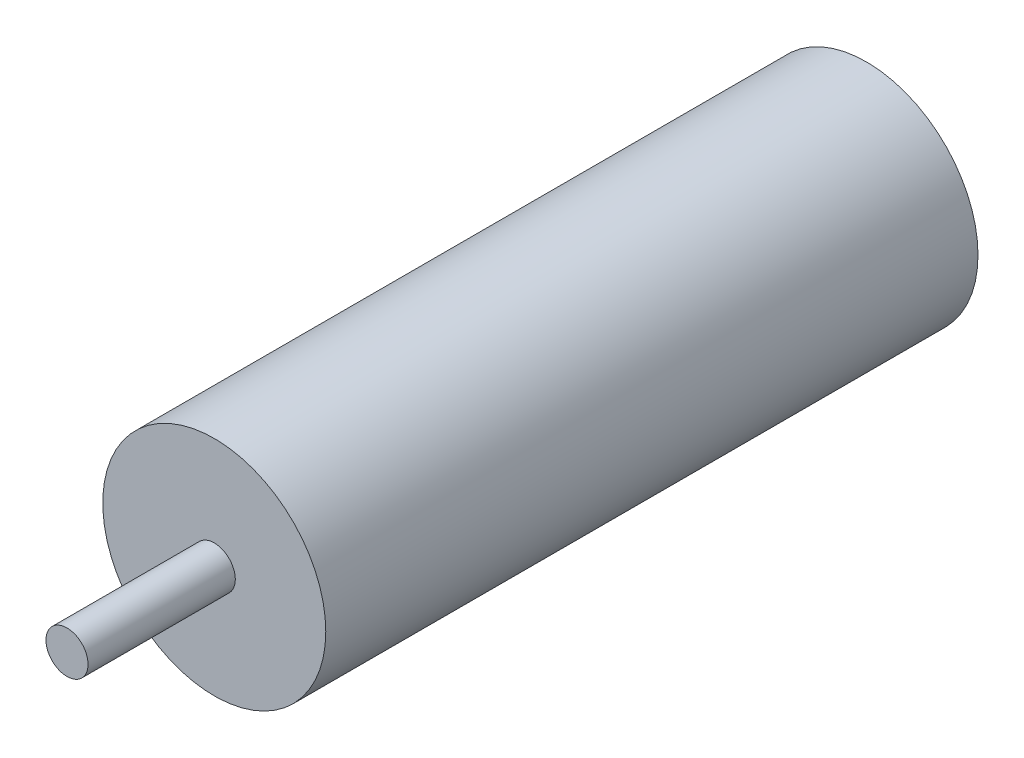
ISO-10303-21;
HEADER;
FILE_DESCRIPTION(('STEP AP214'),'2;1');
FILE_NAME('part.step','',(''),(''),'','','');
FILE_SCHEMA(('AUTOMOTIVE_DESIGN { 1 0 10303 214 1 1 1 1 }'));
ENDSEC;
DATA;
#1=APPLICATION_CONTEXT('core data for automotive mechanical design processes');
#2=APPLICATION_PROTOCOL_DEFINITION('international standard','automotive_design',2000,#1);
#3=PRODUCT_CONTEXT('',#1,'mechanical');
#4=PRODUCT('Part','Part','',(#3));
#5=PRODUCT_RELATED_PRODUCT_CATEGORY('part','',(#4));
#6=PRODUCT_DEFINITION_FORMATION('','',#4);
#7=PRODUCT_DEFINITION_CONTEXT('part definition',#1,'design');
#8=PRODUCT_DEFINITION('design','',#6,#7);
#9=PRODUCT_DEFINITION_SHAPE('','',#8);
#10=(LENGTH_UNIT() NAMED_UNIT(*) SI_UNIT(.MILLI.,.METRE.));
#11=(NAMED_UNIT(*) PLANE_ANGLE_UNIT() SI_UNIT($,.RADIAN.));
#12=(NAMED_UNIT(*) SI_UNIT($,.STERADIAN.) SOLID_ANGLE_UNIT());
#13=UNCERTAINTY_MEASURE_WITH_UNIT(LENGTH_MEASURE(1.E-05),#10,'distance_accuracy_value','');
#14=(GEOMETRIC_REPRESENTATION_CONTEXT(3) GLOBAL_UNCERTAINTY_ASSIGNED_CONTEXT((#13)) GLOBAL_UNIT_ASSIGNED_CONTEXT((#10,
#11,#12)) REPRESENTATION_CONTEXT('',''));
#15=CARTESIAN_POINT('',(0.,0.,0.));
#16=DIRECTION('',(0.,0.,1.));
#17=DIRECTION('',(1.,0.,0.));
#18=AXIS2_PLACEMENT_3D('',#15,#16,#17);
#19=CARTESIAN_POINT('',(0.,0.,31.));
#20=DIRECTION('',(0.,0.,1.));
#21=DIRECTION('',(1.,0.,0.));
#22=AXIS2_PLACEMENT_3D('',#19,#20,#21);
#23=PLANE('',#22);
#24=CARTESIAN_POINT('',(0.,0.,31.));
#25=DIRECTION('',(0.,0.,1.));
#26=DIRECTION('',(1.,0.,0.));
#27=AXIS2_PLACEMENT_3D('',#24,#25,#26);
#28=CIRCLE('',#27,5.3);
#29=CARTESIAN_POINT('',(5.3,0.,31.));
#30=VERTEX_POINT('',#29);
#31=EDGE_CURVE('E10',#30,#30,#28,.T.);
#32=ORIENTED_EDGE('',*,*,#31,.T.);
#33=EDGE_LOOP('',(#32));
#34=FACE_BOUND('',#33,.T.);
#35=CARTESIAN_POINT('',(0.,0.,31.));
#36=DIRECTION('',(0.,0.,1.));
#37=DIRECTION('',(1.,0.,0.));
#38=AXIS2_PLACEMENT_3D('',#35,#36,#37);
#39=CIRCLE('',#38,1.);
#40=CARTESIAN_POINT('',(1.,0.,31.));
#41=VERTEX_POINT('',#40);
#42=EDGE_CURVE('E42',#41,#41,#39,.T.);
#43=ORIENTED_EDGE('',*,*,#42,.F.);
#44=EDGE_LOOP('',(#43));
#45=FACE_BOUND('',#44,.T.);
#46=ADVANCED_FACE('F29',(#34,#45),#23,.T.);
#47=CARTESIAN_POINT('',(0.,0.,31.));
#48=DIRECTION('',(0.,0.,-1.));
#49=DIRECTION('',(-1.,0.,0.));
#50=AXIS2_PLACEMENT_3D('',#47,#48,#49);
#51=CYLINDRICAL_SURFACE('',#50,5.3);
#52=ORIENTED_EDGE('',*,*,#31,.F.);
#53=EDGE_LOOP('',(#52));
#54=FACE_BOUND('',#53,.T.);
#55=CARTESIAN_POINT('',(0.,0.,0.));
#56=DIRECTION('',(0.,0.,1.));
#57=DIRECTION('',(1.,0.,0.));
#58=AXIS2_PLACEMENT_3D('',#55,#56,#57);
#59=CIRCLE('',#58,5.3);
#60=CARTESIAN_POINT('',(5.3,0.,0.));
#61=VERTEX_POINT('',#60);
#62=EDGE_CURVE('E33',#61,#61,#59,.T.);
#63=ORIENTED_EDGE('',*,*,#62,.T.);
#64=EDGE_LOOP('',(#63));
#65=FACE_BOUND('',#64,.T.);
#66=ADVANCED_FACE('F31',(#54,#65),#51,.T.);
#67=CARTESIAN_POINT('',(0.,0.,0.));
#68=DIRECTION('',(0.,0.,1.));
#69=DIRECTION('',(1.,0.,0.));
#70=AXIS2_PLACEMENT_3D('',#67,#68,#69);
#71=PLANE('',#70);
#72=ORIENTED_EDGE('',*,*,#62,.F.);
#73=EDGE_LOOP('',(#72));
#74=FACE_BOUND('',#73,.T.);
#75=ADVANCED_FACE('F53',(#74),#71,.F.);
#76=CARTESIAN_POINT('',(0.,0.,38.));
#77=DIRECTION('',(0.,0.,-1.));
#78=DIRECTION('',(-1.,0.,0.));
#79=AXIS2_PLACEMENT_3D('',#76,#77,#78);
#80=CYLINDRICAL_SURFACE('',#79,1.);
#81=CARTESIAN_POINT('',(0.,0.,38.));
#82=DIRECTION('',(0.,0.,1.));
#83=DIRECTION('',(1.,0.,0.));
#84=AXIS2_PLACEMENT_3D('',#81,#82,#83);
#85=CIRCLE('',#84,1.);
#86=CARTESIAN_POINT('',(1.,0.,38.));
#87=VERTEX_POINT('',#86);
#88=EDGE_CURVE('E40',#87,#87,#85,.T.);
#89=ORIENTED_EDGE('',*,*,#88,.F.);
#90=EDGE_LOOP('',(#89));
#91=FACE_BOUND('',#90,.T.);
#92=ORIENTED_EDGE('',*,*,#42,.T.);
#93=EDGE_LOOP('',(#92));
#94=FACE_BOUND('',#93,.T.);
#95=ADVANCED_FACE('F50',(#91,#94),#80,.T.);
#96=CARTESIAN_POINT('',(0.,0.,38.));
#97=DIRECTION('',(0.,0.,1.));
#98=DIRECTION('',(1.,0.,0.));
#99=AXIS2_PLACEMENT_3D('',#96,#97,#98);
#100=PLANE('',#99);
#101=ORIENTED_EDGE('',*,*,#88,.T.);
#102=EDGE_LOOP('',(#101));
#103=FACE_BOUND('',#102,.T.);
#104=ADVANCED_FACE('F48',(#103),#100,.T.);
#105=CLOSED_SHELL('',(#46,#66,#75,#95,#104));
#106=MANIFOLD_SOLID_BREP('B2',#105);
#107=ADVANCED_BREP_SHAPE_REPRESENTATION('',(#18,#106),#14);
#108=SHAPE_DEFINITION_REPRESENTATION(#9,#107);
ENDSEC;
END-ISO-10303-21;
